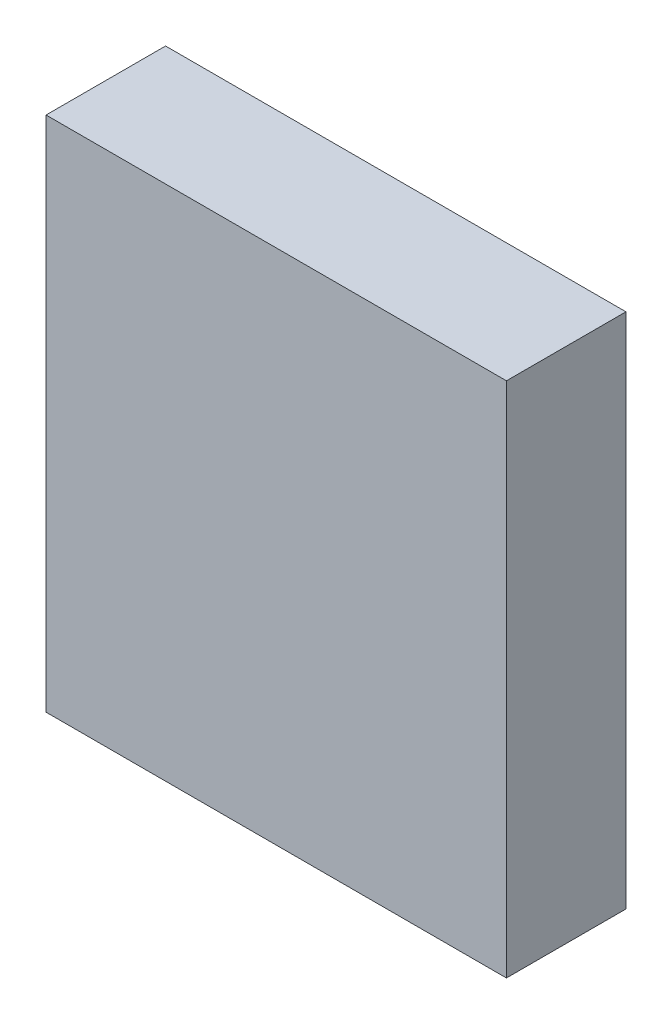
ISO-10303-21;
HEADER;
FILE_DESCRIPTION(('STEP AP214'),'2;1');
FILE_NAME('part.step','',(''),(''),'','','');
FILE_SCHEMA(('AUTOMOTIVE_DESIGN { 1 0 10303 214 1 1 1 1 }'));
ENDSEC;
DATA;
#1=APPLICATION_CONTEXT('core data for automotive mechanical design processes');
#2=APPLICATION_PROTOCOL_DEFINITION('international standard','automotive_design',2000,#1);
#3=PRODUCT_CONTEXT('',#1,'mechanical');
#4=PRODUCT('Part','Part','',(#3));
#5=PRODUCT_RELATED_PRODUCT_CATEGORY('part','',(#4));
#6=PRODUCT_DEFINITION_FORMATION('','',#4);
#7=PRODUCT_DEFINITION_CONTEXT('part definition',#1,'design');
#8=PRODUCT_DEFINITION('design','',#6,#7);
#9=PRODUCT_DEFINITION_SHAPE('','',#8);
#10=(LENGTH_UNIT() NAMED_UNIT(*) SI_UNIT(.MILLI.,.METRE.));
#11=(NAMED_UNIT(*) PLANE_ANGLE_UNIT() SI_UNIT($,.RADIAN.));
#12=(NAMED_UNIT(*) SI_UNIT($,.STERADIAN.) SOLID_ANGLE_UNIT());
#13=UNCERTAINTY_MEASURE_WITH_UNIT(LENGTH_MEASURE(1.E-05),#10,'distance_accuracy_value','');
#14=(GEOMETRIC_REPRESENTATION_CONTEXT(3) GLOBAL_UNCERTAINTY_ASSIGNED_CONTEXT((#13)) GLOBAL_UNIT_ASSIGNED_CONTEXT((#10,
#11,#12)) REPRESENTATION_CONTEXT('',''));
#15=CARTESIAN_POINT('',(0.,0.,0.));
#16=DIRECTION('',(0.,0.,1.));
#17=DIRECTION('',(1.,0.,0.));
#18=AXIS2_PLACEMENT_3D('',#15,#16,#17);
#19=CARTESIAN_POINT('',(-1.17499892,-1.3199999,0.));
#20=DIRECTION('',(-1.,0.,0.));
#21=DIRECTION('',(0.,1.,0.));
#22=AXIS2_PLACEMENT_3D('',#19,#20,#21);
#23=PLANE('',#22);
#24=DIRECTION('',(0.,0.,1.));
#25=VECTOR('',#24,1.);
#26=CARTESIAN_POINT('',(-1.17499892,-1.3199999,0.));
#27=LINE('',#26,#25);
#28=CARTESIAN_POINT('',(-1.17499892,-1.3199999,0.));
#29=VERTEX_POINT('',#28);
#30=CARTESIAN_POINT('',(-1.17499892,-1.3199999,0.60999878));
#31=VERTEX_POINT('',#30);
#32=EDGE_CURVE('E11',#29,#31,#27,.T.);
#33=ORIENTED_EDGE('',*,*,#32,.T.);
#34=DIRECTION('',(0.,1.,0.));
#35=VECTOR('',#34,1.);
#36=CARTESIAN_POINT('',(-1.17499892,-1.3199999,0.60999878));
#37=LINE('',#36,#35);
#38=CARTESIAN_POINT('',(-1.17499892,1.3199999,0.60999878));
#39=VERTEX_POINT('',#38);
#40=EDGE_CURVE('E24',#31,#39,#37,.T.);
#41=ORIENTED_EDGE('',*,*,#40,.T.);
#42=DIRECTION('',(0.,0.,1.));
#43=VECTOR('',#42,1.);
#44=CARTESIAN_POINT('',(-1.17499892,1.3199999,0.));
#45=LINE('',#44,#43);
#46=CARTESIAN_POINT('',(-1.17499892,1.3199999,0.));
#47=VERTEX_POINT('',#46);
#48=EDGE_CURVE('E85',#47,#39,#45,.T.);
#49=ORIENTED_EDGE('',*,*,#48,.F.);
#50=DIRECTION('',(0.,1.,0.));
#51=VECTOR('',#50,1.);
#52=CARTESIAN_POINT('',(-1.17499892,-1.3199999,0.));
#53=LINE('',#52,#51);
#54=EDGE_CURVE('E83',#29,#47,#53,.T.);
#55=ORIENTED_EDGE('',*,*,#54,.F.);
#56=EDGE_LOOP('',(#33,#41,#49,#55));
#57=FACE_BOUND('',#56,.T.);
#58=ADVANCED_FACE('F17',(#57),#23,.T.);
#59=CARTESIAN_POINT('',(-1.17499892,1.3199999,0.));
#60=DIRECTION('',(0.,1.,0.));
#61=DIRECTION('',(1.,0.,0.));
#62=AXIS2_PLACEMENT_3D('',#59,#60,#61);
#63=PLANE('',#62);
#64=ORIENTED_EDGE('',*,*,#48,.T.);
#65=DIRECTION('',(1.,0.,0.));
#66=VECTOR('',#65,1.);
#67=CARTESIAN_POINT('',(-1.17499892,1.3199999,0.60999878));
#68=LINE('',#67,#66);
#69=CARTESIAN_POINT('',(1.17500146,1.3199999,0.60999878));
#70=VERTEX_POINT('',#69);
#71=EDGE_CURVE('E81',#39,#70,#68,.T.);
#72=ORIENTED_EDGE('',*,*,#71,.T.);
#73=DIRECTION('',(0.,0.,1.));
#74=VECTOR('',#73,1.);
#75=CARTESIAN_POINT('',(1.17500146,1.3199999,0.));
#76=LINE('',#75,#74);
#77=CARTESIAN_POINT('',(1.17500146,1.3199999,0.));
#78=VERTEX_POINT('',#77);
#79=EDGE_CURVE('E79',#78,#70,#76,.T.);
#80=ORIENTED_EDGE('',*,*,#79,.F.);
#81=DIRECTION('',(1.,0.,0.));
#82=VECTOR('',#81,1.);
#83=CARTESIAN_POINT('',(-1.17499892,1.3199999,0.));
#84=LINE('',#83,#82);
#85=EDGE_CURVE('E70',#47,#78,#84,.T.);
#86=ORIENTED_EDGE('',*,*,#85,.F.);
#87=EDGE_LOOP('',(#64,#72,#80,#86));
#88=FACE_BOUND('',#87,.T.);
#89=ADVANCED_FACE('F90',(#88),#63,.T.);
#90=CARTESIAN_POINT('',(1.17500146,1.3199999,0.));
#91=DIRECTION('',(1.,0.,0.));
#92=DIRECTION('',(0.,-1.,0.));
#93=AXIS2_PLACEMENT_3D('',#90,#91,#92);
#94=PLANE('',#93);
#95=ORIENTED_EDGE('',*,*,#79,.T.);
#96=DIRECTION('',(0.,-1.,0.));
#97=VECTOR('',#96,1.);
#98=CARTESIAN_POINT('',(1.17500146,1.3199999,0.60999878));
#99=LINE('',#98,#97);
#100=CARTESIAN_POINT('',(1.17500146,-1.3199999,0.60999878));
#101=VERTEX_POINT('',#100);
#102=EDGE_CURVE('E60',#70,#101,#99,.T.);
#103=ORIENTED_EDGE('',*,*,#102,.T.);
#104=DIRECTION('',(0.,0.,1.));
#105=VECTOR('',#104,1.);
#106=CARTESIAN_POINT('',(1.17500146,-1.3199999,0.));
#107=LINE('',#106,#105);
#108=CARTESIAN_POINT('',(1.17500146,-1.3199999,0.));
#109=VERTEX_POINT('',#108);
#110=EDGE_CURVE('E54',#109,#101,#107,.T.);
#111=ORIENTED_EDGE('',*,*,#110,.F.);
#112=DIRECTION('',(0.,-1.,0.));
#113=VECTOR('',#112,1.);
#114=CARTESIAN_POINT('',(1.17500146,1.3199999,0.));
#115=LINE('',#114,#113);
#116=EDGE_CURVE('E58',#78,#109,#115,.T.);
#117=ORIENTED_EDGE('',*,*,#116,.F.);
#118=EDGE_LOOP('',(#95,#103,#111,#117));
#119=FACE_BOUND('',#118,.T.);
#120=ADVANCED_FACE('F57',(#119),#94,.T.);
#121=CARTESIAN_POINT('',(1.17500146,-1.3199999,0.));
#122=DIRECTION('',(0.,-1.,0.));
#123=DIRECTION('',(-1.,0.,0.));
#124=AXIS2_PLACEMENT_3D('',#121,#122,#123);
#125=PLANE('',#124);
#126=ORIENTED_EDGE('',*,*,#110,.T.);
#127=DIRECTION('',(-1.,0.,0.));
#128=VECTOR('',#127,1.);
#129=CARTESIAN_POINT('',(1.17500146,-1.3199999,0.60999878));
#130=LINE('',#129,#128);
#131=EDGE_CURVE('E71',#101,#31,#130,.T.);
#132=ORIENTED_EDGE('',*,*,#131,.T.);
#133=ORIENTED_EDGE('',*,*,#32,.F.);
#134=DIRECTION('',(-1.,0.,0.));
#135=VECTOR('',#134,1.);
#136=CARTESIAN_POINT('',(1.17500146,-1.3199999,0.));
#137=LINE('',#136,#135);
#138=EDGE_CURVE('E68',#109,#29,#137,.T.);
#139=ORIENTED_EDGE('',*,*,#138,.F.);
#140=EDGE_LOOP('',(#126,#132,#133,#139));
#141=FACE_BOUND('',#140,.T.);
#142=ADVANCED_FACE('F73',(#141),#125,.T.);
#143=CARTESIAN_POINT('',(-1.17499892,-1.3199999,0.));
#144=DIRECTION('',(0.,0.,1.));
#145=DIRECTION('',(1.,0.,0.));
#146=AXIS2_PLACEMENT_3D('',#143,#144,#145);
#147=PLANE('',#146);
#148=ORIENTED_EDGE('',*,*,#54,.T.);
#149=ORIENTED_EDGE('',*,*,#85,.T.);
#150=ORIENTED_EDGE('',*,*,#116,.T.);
#151=ORIENTED_EDGE('',*,*,#138,.T.);
#152=EDGE_LOOP('',(#148,#149,#150,#151));
#153=FACE_BOUND('',#152,.T.);
#154=ADVANCED_FACE('F67',(#153),#147,.F.);
#155=CARTESIAN_POINT('',(-1.17499892,-1.3199999,0.60999878));
#156=DIRECTION('',(0.,0.,1.));
#157=DIRECTION('',(1.,0.,0.));
#158=AXIS2_PLACEMENT_3D('',#155,#156,#157);
#159=PLANE('',#158);
#160=ORIENTED_EDGE('',*,*,#131,.F.);
#161=ORIENTED_EDGE('',*,*,#102,.F.);
#162=ORIENTED_EDGE('',*,*,#71,.F.);
#163=ORIENTED_EDGE('',*,*,#40,.F.);
#164=EDGE_LOOP('',(#160,#161,#162,#163));
#165=FACE_BOUND('',#164,.T.);
#166=ADVANCED_FACE('F91',(#165),#159,.T.);
#167=CLOSED_SHELL('',(#58,#89,#120,#142,#154,#166));
#168=MANIFOLD_SOLID_BREP('B1',#167);
#169=ADVANCED_BREP_SHAPE_REPRESENTATION('',(#18,#168),#14);
#170=SHAPE_DEFINITION_REPRESENTATION(#9,#169);
ENDSEC;
END-ISO-10303-21;
